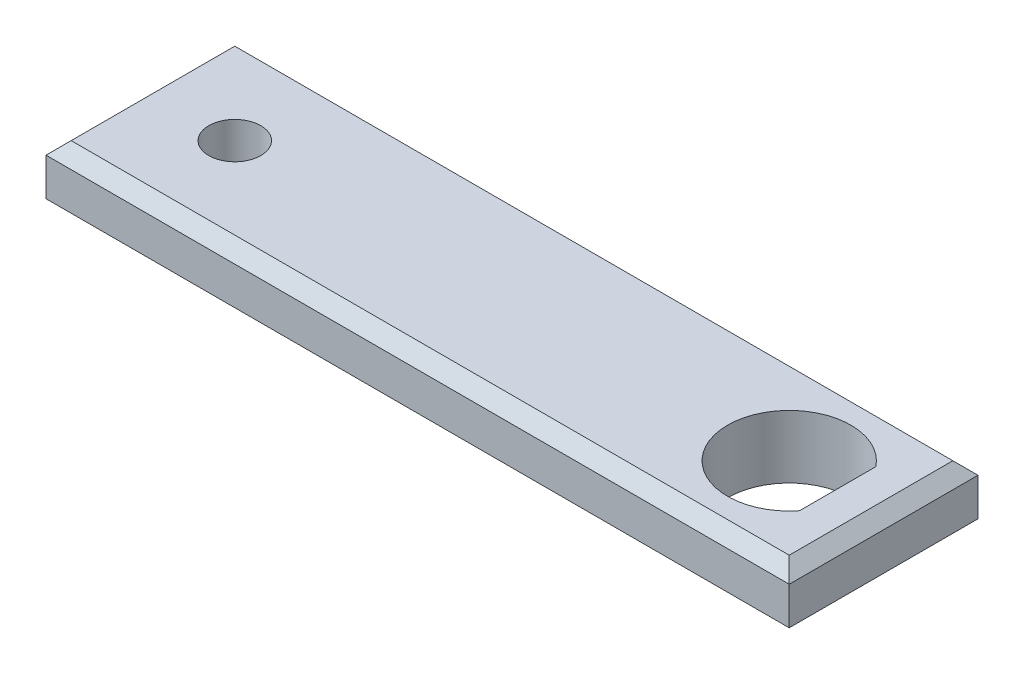
ISO-10303-21;
HEADER;
FILE_DESCRIPTION(('STEP AP214'),'2;1');
FILE_NAME('part.step','',(''),(''),'','','');
FILE_SCHEMA(('AUTOMOTIVE_DESIGN { 1 0 10303 214 1 1 1 1 }'));
ENDSEC;
DATA;
#1=APPLICATION_CONTEXT('core data for automotive mechanical design processes');
#2=APPLICATION_PROTOCOL_DEFINITION('international standard','automotive_design',2000,#1);
#3=PRODUCT_CONTEXT('',#1,'mechanical');
#4=PRODUCT('Part','Part','',(#3));
#5=PRODUCT_RELATED_PRODUCT_CATEGORY('part','',(#4));
#6=PRODUCT_DEFINITION_FORMATION('','',#4);
#7=PRODUCT_DEFINITION_CONTEXT('part definition',#1,'design');
#8=PRODUCT_DEFINITION('design','',#6,#7);
#9=PRODUCT_DEFINITION_SHAPE('','',#8);
#10=(LENGTH_UNIT() NAMED_UNIT(*) SI_UNIT(.MILLI.,.METRE.));
#11=(NAMED_UNIT(*) PLANE_ANGLE_UNIT() SI_UNIT($,.RADIAN.));
#12=(NAMED_UNIT(*) SI_UNIT($,.STERADIAN.) SOLID_ANGLE_UNIT());
#13=UNCERTAINTY_MEASURE_WITH_UNIT(LENGTH_MEASURE(1.E-05),#10,'distance_accuracy_value','');
#14=(GEOMETRIC_REPRESENTATION_CONTEXT(3) GLOBAL_UNCERTAINTY_ASSIGNED_CONTEXT((#13)) GLOBAL_UNIT_ASSIGNED_CONTEXT((#10,
#11,#12)) REPRESENTATION_CONTEXT('',''));
#15=CARTESIAN_POINT('',(0.,0.,0.));
#16=DIRECTION('',(0.,0.,1.));
#17=DIRECTION('',(1.,0.,0.));
#18=AXIS2_PLACEMENT_3D('',#15,#16,#17);
#19=CARTESIAN_POINT('',(0.,0.,19.05));
#20=DIRECTION('',(-1.,0.,0.));
#21=DIRECTION('',(0.,0.,1.));
#22=AXIS2_PLACEMENT_3D('',#19,#20,#21);
#23=PLANE('',#22);
#24=DIRECTION('',(0.,1.,0.));
#25=VECTOR('',#24,1.);
#26=CARTESIAN_POINT('',(0.,0.,0.));
#27=LINE('',#26,#25);
#28=CARTESIAN_POINT('',(0.,1.26999999999999,0.));
#29=VERTEX_POINT('',#28);
#30=CARTESIAN_POINT('',(0.,5.08000000000003,0.));
#31=VERTEX_POINT('',#30);
#32=EDGE_CURVE('E141',#29,#31,#27,.T.);
#33=ORIENTED_EDGE('',*,*,#32,.F.);
#34=DIRECTION('',(0.,0.,1.));
#35=VECTOR('',#34,1.);
#36=CARTESIAN_POINT('',(0.,1.26999999999999,19.05));
#37=LINE('',#36,#35);
#38=CARTESIAN_POINT('',(0.,1.26999999999999,19.05));
#39=VERTEX_POINT('',#38);
#40=EDGE_CURVE('E175',#29,#39,#37,.T.);
#41=ORIENTED_EDGE('',*,*,#40,.T.);
#42=DIRECTION('',(0.,1.,0.));
#43=VECTOR('',#42,1.);
#44=CARTESIAN_POINT('',(0.,0.,19.05));
#45=LINE('',#44,#43);
#46=CARTESIAN_POINT('',(0.,5.08000000000003,19.05));
#47=VERTEX_POINT('',#46);
#48=EDGE_CURVE('E143',#39,#47,#45,.T.);
#49=ORIENTED_EDGE('',*,*,#48,.T.);
#50=DIRECTION('',(0.,0.,-1.));
#51=VECTOR('',#50,1.);
#52=CARTESIAN_POINT('',(0.,5.08000000000003,0.));
#53=LINE('',#52,#51);
#54=EDGE_CURVE('E173',#47,#31,#53,.T.);
#55=ORIENTED_EDGE('',*,*,#54,.T.);
#56=EDGE_LOOP('',(#33,#41,#49,#55));
#57=FACE_BOUND('',#56,.T.);
#58=ADVANCED_FACE('F37',(#57),#23,.T.);
#59=CARTESIAN_POINT('',(0.,0.,19.05));
#60=DIRECTION('',(0.,1.,0.));
#61=DIRECTION('',(0.,0.,1.));
#62=AXIS2_PLACEMENT_3D('',#59,#60,#61);
#63=PLANE('',#62);
#64=DIRECTION('',(1.,0.,0.));
#65=VECTOR('',#64,1.);
#66=CARTESIAN_POINT('',(75.,0.,1.26999999999999));
#67=LINE('',#66,#65);
#68=CARTESIAN_POINT('',(1.26999999999999,0.,1.26999999999999));
#69=VERTEX_POINT('',#68);
#70=CARTESIAN_POINT('',(73.73,0.,1.26999999999999));
#71=VERTEX_POINT('',#70);
#72=EDGE_CURVE('E160',#69,#71,#67,.T.);
#73=ORIENTED_EDGE('',*,*,#72,.T.);
#74=DIRECTION('',(0.,0.,1.));
#75=VECTOR('',#74,1.);
#76=CARTESIAN_POINT('',(73.73,0.,19.05));
#77=LINE('',#76,#75);
#78=CARTESIAN_POINT('',(73.73,0.,17.78));
#79=VERTEX_POINT('',#78);
#80=EDGE_CURVE('E166',#71,#79,#77,.T.);
#81=ORIENTED_EDGE('',*,*,#80,.T.);
#82=DIRECTION('',(-1.,0.,0.));
#83=VECTOR('',#82,1.);
#84=CARTESIAN_POINT('',(0.,0.,17.78));
#85=LINE('',#84,#83);
#86=CARTESIAN_POINT('',(1.26999999999999,0.,17.78));
#87=VERTEX_POINT('',#86);
#88=EDGE_CURVE('E164',#79,#87,#85,.T.);
#89=ORIENTED_EDGE('',*,*,#88,.T.);
#90=DIRECTION('',(0.,0.,-1.));
#91=VECTOR('',#90,1.);
#92=CARTESIAN_POINT('',(1.26999999999999,0.,0.));
#93=LINE('',#92,#91);
#94=EDGE_CURVE('E162',#87,#69,#93,.T.);
#95=ORIENTED_EDGE('',*,*,#94,.T.);
#96=EDGE_LOOP('',(#73,#81,#89,#95));
#97=FACE_BOUND('',#96,.T.);
#98=CARTESIAN_POINT('',(9.525,0.,9.525));
#99=DIRECTION('',(0.,1.,0.));
#100=DIRECTION('',(-1.,0.,0.));
#101=AXIS2_PLACEMENT_3D('',#98,#99,#100);
#102=CIRCLE('',#101,2.62246009401009);
#103=CARTESIAN_POINT('',(6.90253990598991,0.,9.525));
#104=VERTEX_POINT('',#103);
#105=EDGE_CURVE('E139',#104,#104,#102,.T.);
#106=ORIENTED_EDGE('',*,*,#105,.T.);
#107=EDGE_LOOP('',(#106));
#108=FACE_BOUND('',#107,.T.);
#109=DIRECTION('',(0.,0.,1.));
#110=VECTOR('',#109,1.);
#111=CARTESIAN_POINT('',(70.3645,0.,5.67551708017818));
#112=LINE('',#111,#110);
#113=CARTESIAN_POINT('',(70.3645,0.,5.67551708017818));
#114=VERTEX_POINT('',#113);
#115=CARTESIAN_POINT('',(70.3645,0.,13.3744829198218));
#116=VERTEX_POINT('',#115);
#117=EDGE_CURVE('E115',#114,#116,#112,.T.);
#118=ORIENTED_EDGE('',*,*,#117,.F.);
#119=CARTESIAN_POINT('',(65.475,0.,9.525));
#120=DIRECTION('',(0.,1.,0.));
#121=DIRECTION('',(-1.,0.,0.));
#122=AXIS2_PLACEMENT_3D('',#119,#120,#121);
#123=CIRCLE('',#122,6.22300000000001);
#124=EDGE_CURVE('E124',#114,#116,#123,.T.);
#125=ORIENTED_EDGE('',*,*,#124,.T.);
#126=EDGE_LOOP('',(#118,#125));
#127=FACE_BOUND('',#126,.T.);
#128=ADVANCED_FACE('F131',(#97,#108,#127),#63,.F.);
#129=CARTESIAN_POINT('',(75.,6.34999999999999,19.05));
#130=DIRECTION('',(1.,0.,0.));
#131=DIRECTION('',(0.,0.,-1.));
#132=AXIS2_PLACEMENT_3D('',#129,#130,#131);
#133=PLANE('',#132);
#134=DIRECTION('',(0.,-1.,0.));
#135=VECTOR('',#134,1.);
#136=CARTESIAN_POINT('',(75.,6.34999999999999,19.05));
#137=LINE('',#136,#135);
#138=CARTESIAN_POINT('',(75.,5.08,19.05));
#139=VERTEX_POINT('',#138);
#140=CARTESIAN_POINT('',(75.,1.26999999999999,19.05));
#141=VERTEX_POINT('',#140);
#142=EDGE_CURVE('E146',#139,#141,#137,.T.);
#143=ORIENTED_EDGE('',*,*,#142,.T.);
#144=DIRECTION('',(0.,0.,-1.));
#145=VECTOR('',#144,1.);
#146=CARTESIAN_POINT('',(75.,1.26999999999999,0.));
#147=LINE('',#146,#145);
#148=CARTESIAN_POINT('',(75.,1.26999999999999,0.));
#149=VERTEX_POINT('',#148);
#150=EDGE_CURVE('E157',#141,#149,#147,.T.);
#151=ORIENTED_EDGE('',*,*,#150,.T.);
#152=DIRECTION('',(0.,-1.,0.));
#153=VECTOR('',#152,1.);
#154=CARTESIAN_POINT('',(75.,6.34999999999999,0.));
#155=LINE('',#154,#153);
#156=CARTESIAN_POINT('',(75.,5.08,0.));
#157=VERTEX_POINT('',#156);
#158=EDGE_CURVE('E147',#157,#149,#155,.T.);
#159=ORIENTED_EDGE('',*,*,#158,.F.);
#160=DIRECTION('',(0.,0.,1.));
#161=VECTOR('',#160,1.);
#162=CARTESIAN_POINT('',(75.,5.08,19.05));
#163=LINE('',#162,#161);
#164=EDGE_CURVE('E150',#157,#139,#163,.T.);
#165=ORIENTED_EDGE('',*,*,#164,.T.);
#166=EDGE_LOOP('',(#143,#151,#159,#165));
#167=FACE_BOUND('',#166,.T.);
#168=ADVANCED_FACE('F225',(#167),#133,.T.);
#169=CARTESIAN_POINT('',(75.,6.34999999999999,19.05));
#170=DIRECTION('',(0.,-1.,0.));
#171=DIRECTION('',(1.,0.,0.));
#172=AXIS2_PLACEMENT_3D('',#169,#170,#171);
#173=PLANE('',#172);
#174=DIRECTION('',(1.,0.,0.));
#175=VECTOR('',#174,1.);
#176=CARTESIAN_POINT('',(75.,6.34999999999999,17.78));
#177=LINE('',#176,#175);
#178=CARTESIAN_POINT('',(1.27000000000001,6.35000000000001,17.78));
#179=VERTEX_POINT('',#178);
#180=CARTESIAN_POINT('',(73.73,6.34999999999999,17.78));
#181=VERTEX_POINT('',#180);
#182=EDGE_CURVE('E46',#179,#181,#177,.T.);
#183=ORIENTED_EDGE('',*,*,#182,.T.);
#184=DIRECTION('',(0.,0.,-1.));
#185=VECTOR('',#184,1.);
#186=CARTESIAN_POINT('',(73.73,6.34999999999999,0.));
#187=LINE('',#186,#185);
#188=CARTESIAN_POINT('',(73.73,6.34999999999999,1.26999999999999));
#189=VERTEX_POINT('',#188);
#190=EDGE_CURVE('E11',#181,#189,#187,.T.);
#191=ORIENTED_EDGE('',*,*,#190,.T.);
#192=DIRECTION('',(-1.,0.,0.));
#193=VECTOR('',#192,1.);
#194=CARTESIAN_POINT('',(0.,6.35000000000001,1.26999999999999));
#195=LINE('',#194,#193);
#196=CARTESIAN_POINT('',(1.27000000000001,6.35000000000001,1.26999999999999));
#197=VERTEX_POINT('',#196);
#198=EDGE_CURVE('E181',#189,#197,#195,.T.);
#199=ORIENTED_EDGE('',*,*,#198,.T.);
#200=DIRECTION('',(0.,0.,1.));
#201=VECTOR('',#200,1.);
#202=CARTESIAN_POINT('',(1.27000000000001,6.35000000000001,19.05));
#203=LINE('',#202,#201);
#204=EDGE_CURVE('E57',#197,#179,#203,.T.);
#205=ORIENTED_EDGE('',*,*,#204,.T.);
#206=EDGE_LOOP('',(#183,#191,#199,#205));
#207=FACE_BOUND('',#206,.T.);
#208=CARTESIAN_POINT('',(9.525,6.35000000000001,9.525));
#209=DIRECTION('',(0.,1.,0.));
#210=DIRECTION('',(-1.,0.,0.));
#211=AXIS2_PLACEMENT_3D('',#208,#209,#210);
#212=CIRCLE('',#211,2.62246009401009);
#213=CARTESIAN_POINT('',(6.90253990598991,6.35000000000001,9.525));
#214=VERTEX_POINT('',#213);
#215=EDGE_CURVE('E136',#214,#214,#212,.T.);
#216=ORIENTED_EDGE('',*,*,#215,.F.);
#217=EDGE_LOOP('',(#216));
#218=FACE_BOUND('',#217,.T.);
#219=DIRECTION('',(0.,0.,1.));
#220=VECTOR('',#219,1.);
#221=CARTESIAN_POINT('',(70.3645,6.35,5.67551708017818));
#222=LINE('',#221,#220);
#223=CARTESIAN_POINT('',(70.3645,6.35,5.67551708017818));
#224=VERTEX_POINT('',#223);
#225=CARTESIAN_POINT('',(70.3645,6.34999999999999,13.3744829198218));
#226=VERTEX_POINT('',#225);
#227=EDGE_CURVE('E132',#224,#226,#222,.T.);
#228=ORIENTED_EDGE('',*,*,#227,.T.);
#229=CARTESIAN_POINT('',(65.475,6.35000000000001,9.525));
#230=DIRECTION('',(0.,1.,0.));
#231=DIRECTION('',(-1.,0.,0.));
#232=AXIS2_PLACEMENT_3D('',#229,#230,#231);
#233=CIRCLE('',#232,6.22300000000001);
#234=EDGE_CURVE('E129',#224,#226,#233,.T.);
#235=ORIENTED_EDGE('',*,*,#234,.F.);
#236=EDGE_LOOP('',(#228,#235));
#237=FACE_BOUND('',#236,.T.);
#238=ADVANCED_FACE('F261',(#207,#218,#237),#173,.F.);
#239=CARTESIAN_POINT('',(0.,0.,19.05));
#240=DIRECTION('',(0.,0.,-1.));
#241=DIRECTION('',(-1.,0.,0.));
#242=AXIS2_PLACEMENT_3D('',#239,#240,#241);
#243=PLANE('',#242);
#244=ORIENTED_EDGE('',*,*,#48,.F.);
#245=DIRECTION('',(1.,0.,0.));
#246=VECTOR('',#245,1.);
#247=CARTESIAN_POINT('',(0.,1.26999999999999,19.05));
#248=LINE('',#247,#246);
#249=EDGE_CURVE('E171',#39,#141,#248,.T.);
#250=ORIENTED_EDGE('',*,*,#249,.T.);
#251=ORIENTED_EDGE('',*,*,#142,.F.);
#252=DIRECTION('',(-1.,0.,0.));
#253=VECTOR('',#252,1.);
#254=CARTESIAN_POINT('',(0.,5.08000000000003,19.05));
#255=LINE('',#254,#253);
#256=EDGE_CURVE('E169',#139,#47,#255,.T.);
#257=ORIENTED_EDGE('',*,*,#256,.T.);
#258=EDGE_LOOP('',(#244,#250,#251,#257));
#259=FACE_BOUND('',#258,.T.);
#260=ADVANCED_FACE('F241',(#259),#243,.F.);
#261=CARTESIAN_POINT('',(0.,0.,0.));
#262=DIRECTION('',(0.,0.,-1.));
#263=DIRECTION('',(-1.,0.,0.));
#264=AXIS2_PLACEMENT_3D('',#261,#262,#263);
#265=PLANE('',#264);
#266=ORIENTED_EDGE('',*,*,#158,.T.);
#267=DIRECTION('',(-1.,0.,0.));
#268=VECTOR('',#267,1.);
#269=CARTESIAN_POINT('',(0.,1.26999999999999,0.));
#270=LINE('',#269,#268);
#271=EDGE_CURVE('E179',#149,#29,#270,.T.);
#272=ORIENTED_EDGE('',*,*,#271,.T.);
#273=ORIENTED_EDGE('',*,*,#32,.T.);
#274=DIRECTION('',(1.,0.,0.));
#275=VECTOR('',#274,1.);
#276=CARTESIAN_POINT('',(75.,5.08,0.));
#277=LINE('',#276,#275);
#278=EDGE_CURVE('E177',#31,#157,#277,.T.);
#279=ORIENTED_EDGE('',*,*,#278,.T.);
#280=EDGE_LOOP('',(#266,#272,#273,#279));
#281=FACE_BOUND('',#280,.T.);
#282=ADVANCED_FACE('F215',(#281),#265,.T.);
#283=CARTESIAN_POINT('',(65.475,0.,9.525));
#284=DIRECTION('',(0.,1.,0.));
#285=DIRECTION('',(-1.,0.,0.));
#286=AXIS2_PLACEMENT_3D('',#283,#284,#285);
#287=CYLINDRICAL_SURFACE('',#286,6.22300000000001);
#288=ORIENTED_EDGE('',*,*,#234,.T.);
#289=DIRECTION('',(0.,1.,0.));
#290=VECTOR('',#289,1.);
#291=CARTESIAN_POINT('',(70.3645,0.,13.3744829198218));
#292=LINE('',#291,#290);
#293=EDGE_CURVE('E119',#116,#226,#292,.T.);
#294=ORIENTED_EDGE('',*,*,#293,.F.);
#295=ORIENTED_EDGE('',*,*,#124,.F.);
#296=DIRECTION('',(0.,1.,0.));
#297=VECTOR('',#296,1.);
#298=CARTESIAN_POINT('',(70.3645,0.,5.67551708017818));
#299=LINE('',#298,#297);
#300=EDGE_CURVE('E121',#114,#224,#299,.T.);
#301=ORIENTED_EDGE('',*,*,#300,.T.);
#302=EDGE_LOOP('',(#288,#294,#295,#301));
#303=FACE_BOUND('',#302,.T.);
#304=ADVANCED_FACE('F127',(#303),#287,.F.);
#305=CARTESIAN_POINT('',(70.3645,0.,5.67551708017818));
#306=DIRECTION('',(-1.,0.,0.));
#307=DIRECTION('',(0.,-1.,0.));
#308=AXIS2_PLACEMENT_3D('',#305,#306,#307);
#309=PLANE('',#308);
#310=ORIENTED_EDGE('',*,*,#227,.F.);
#311=ORIENTED_EDGE('',*,*,#300,.F.);
#312=ORIENTED_EDGE('',*,*,#117,.T.);
#313=ORIENTED_EDGE('',*,*,#293,.T.);
#314=EDGE_LOOP('',(#310,#311,#312,#313));
#315=FACE_BOUND('',#314,.T.);
#316=ADVANCED_FACE('F118',(#315),#309,.T.);
#317=CARTESIAN_POINT('',(9.525,0.,9.525));
#318=DIRECTION('',(0.,1.,0.));
#319=DIRECTION('',(-1.,0.,0.));
#320=AXIS2_PLACEMENT_3D('',#317,#318,#319);
#321=CYLINDRICAL_SURFACE('',#320,2.62246009401009);
#322=ORIENTED_EDGE('',*,*,#105,.F.);
#323=EDGE_LOOP('',(#322));
#324=FACE_BOUND('',#323,.T.);
#325=ORIENTED_EDGE('',*,*,#215,.T.);
#326=EDGE_LOOP('',(#325));
#327=FACE_BOUND('',#326,.T.);
#328=ADVANCED_FACE('F251',(#324,#327),#321,.F.);
#329=CARTESIAN_POINT('',(1.26999999999999,0.,19.05));
#330=DIRECTION('',(-0.707106781186546,-0.707106781186549,0.));
#331=DIRECTION('',(0.,0.,1.));
#332=AXIS2_PLACEMENT_3D('',#329,#330,#331);
#333=PLANE('',#332);
#334=DIRECTION('',(-0.577350269189627,0.577350269189624,-0.577350269189627));
#335=VECTOR('',#334,1.);
#336=CARTESIAN_POINT('',(0.84666666666666,0.42333333333333,0.846666666666661));
#337=LINE('',#336,#335);
#338=EDGE_CURVE('E189',#69,#29,#337,.T.);
#339=ORIENTED_EDGE('',*,*,#338,.F.);
#340=ORIENTED_EDGE('',*,*,#94,.F.);
#341=DIRECTION('',(0.577350269189627,-0.577350269189624,-0.577350269189627));
#342=VECTOR('',#341,1.);
#343=CARTESIAN_POINT('',(0.84666666666666,0.42333333333333,18.2033333333333));
#344=LINE('',#343,#342);
#345=EDGE_CURVE('E192',#39,#87,#344,.T.);
#346=ORIENTED_EDGE('',*,*,#345,.F.);
#347=ORIENTED_EDGE('',*,*,#40,.F.);
#348=EDGE_LOOP('',(#339,#340,#346,#347));
#349=FACE_BOUND('',#348,.T.);
#350=ADVANCED_FACE('F238',(#349),#333,.T.);
#351=CARTESIAN_POINT('',(0.,1.26999999999999,19.05));
#352=DIRECTION('',(0.,0.70710678118655,-0.707106781186545));
#353=DIRECTION('',(1.,0.,0.));
#354=AXIS2_PLACEMENT_3D('',#351,#352,#353);
#355=PLANE('',#354);
#356=ORIENTED_EDGE('',*,*,#345,.T.);
#357=ORIENTED_EDGE('',*,*,#88,.F.);
#358=DIRECTION('',(-0.577350269189631,-0.577350269189622,-0.577350269189625));
#359=VECTOR('',#358,1.);
#360=CARTESIAN_POINT('',(49.9999999999996,-23.7300000000001,-5.95000000000019));
#361=LINE('',#360,#359);
#362=EDGE_CURVE('E187',#141,#79,#361,.T.);
#363=ORIENTED_EDGE('',*,*,#362,.F.);
#364=ORIENTED_EDGE('',*,*,#249,.F.);
#365=EDGE_LOOP('',(#356,#357,#363,#364));
#366=FACE_BOUND('',#365,.T.);
#367=ADVANCED_FACE('F243',(#366),#355,.F.);
#368=CARTESIAN_POINT('',(0.,0.,1.26999999999999));
#369=DIRECTION('',(0.,-0.70710678118655,-0.707106781186545));
#370=DIRECTION('',(-1.,0.,0.));
#371=AXIS2_PLACEMENT_3D('',#368,#369,#370);
#372=PLANE('',#371);
#373=ORIENTED_EDGE('',*,*,#338,.T.);
#374=ORIENTED_EDGE('',*,*,#271,.F.);
#375=DIRECTION('',(-0.577350269189631,-0.577350269189622,0.577350269189625));
#376=VECTOR('',#375,1.);
#377=CARTESIAN_POINT('',(49.1533333333329,-24.5766666666667,25.8466666666668));
#378=LINE('',#377,#376);
#379=EDGE_CURVE('E185',#71,#149,#378,.F.);
#380=ORIENTED_EDGE('',*,*,#379,.F.);
#381=ORIENTED_EDGE('',*,*,#72,.F.);
#382=EDGE_LOOP('',(#373,#374,#380,#381));
#383=FACE_BOUND('',#382,.T.);
#384=ADVANCED_FACE('F220',(#383),#372,.T.);
#385=CARTESIAN_POINT('',(75.,1.26999999999999,19.05));
#386=DIRECTION('',(0.707106781186542,-0.707106781186553,0.));
#387=DIRECTION('',(0.,0.,1.));
#388=AXIS2_PLACEMENT_3D('',#385,#386,#387);
#389=PLANE('',#388);
#390=ORIENTED_EDGE('',*,*,#362,.T.);
#391=ORIENTED_EDGE('',*,*,#80,.F.);
#392=ORIENTED_EDGE('',*,*,#379,.T.);
#393=ORIENTED_EDGE('',*,*,#150,.F.);
#394=EDGE_LOOP('',(#390,#391,#392,#393));
#395=FACE_BOUND('',#394,.T.);
#396=ADVANCED_FACE('F230',(#395),#389,.T.);
#397=CARTESIAN_POINT('',(0.,5.08000000000003,19.05));
#398=DIRECTION('',(-0.707106781186542,0.707106781186553,0.));
#399=DIRECTION('',(0.,0.,1.));
#400=AXIS2_PLACEMENT_3D('',#397,#398,#399);
#401=PLANE('',#400);
#402=DIRECTION('',(0.577350269189631,0.577350269189622,0.577350269189625));
#403=VECTOR('',#402,1.);
#404=CARTESIAN_POINT('',(25.8466666666671,30.9266666666667,25.8466666666668));
#405=LINE('',#404,#403);
#406=EDGE_CURVE('E198',#31,#197,#405,.T.);
#407=ORIENTED_EDGE('',*,*,#406,.F.);
#408=ORIENTED_EDGE('',*,*,#54,.F.);
#409=DIRECTION('',(-0.577350269189631,-0.577350269189622,0.577350269189625));
#410=VECTOR('',#409,1.);
#411=CARTESIAN_POINT('',(0.,5.08000000000003,19.05));
#412=LINE('',#411,#410);
#413=EDGE_CURVE('E41',#179,#47,#412,.T.);
#414=ORIENTED_EDGE('',*,*,#413,.F.);
#415=ORIENTED_EDGE('',*,*,#204,.F.);
#416=EDGE_LOOP('',(#407,#408,#414,#415));
#417=FACE_BOUND('',#416,.T.);
#418=ADVANCED_FACE('F39',(#417),#401,.T.);
#419=CARTESIAN_POINT('',(0.,5.08000000000003,19.05));
#420=DIRECTION('',(0.,-0.707106781186549,-0.707106781186546));
#421=DIRECTION('',(-1.,0.,0.));
#422=AXIS2_PLACEMENT_3D('',#419,#420,#421);
#423=PLANE('',#422);
#424=ORIENTED_EDGE('',*,*,#413,.T.);
#425=ORIENTED_EDGE('',*,*,#256,.F.);
#426=DIRECTION('',(0.577350269189627,-0.577350269189624,0.577350269189627));
#427=VECTOR('',#426,1.);
#428=CARTESIAN_POINT('',(49.9999999999999,30.08,-5.9500000000001));
#429=LINE('',#428,#427);
#430=EDGE_CURVE('E197',#181,#139,#429,.T.);
#431=ORIENTED_EDGE('',*,*,#430,.F.);
#432=ORIENTED_EDGE('',*,*,#182,.F.);
#433=EDGE_LOOP('',(#424,#425,#431,#432));
#434=FACE_BOUND('',#433,.T.);
#435=ADVANCED_FACE('F207',(#434),#423,.F.);
#436=CARTESIAN_POINT('',(75.,6.34999999999999,1.26999999999999));
#437=DIRECTION('',(0.,0.707106781186549,-0.707106781186546));
#438=DIRECTION('',(1.,0.,0.));
#439=AXIS2_PLACEMENT_3D('',#436,#437,#438);
#440=PLANE('',#439);
#441=ORIENTED_EDGE('',*,*,#406,.T.);
#442=ORIENTED_EDGE('',*,*,#198,.F.);
#443=DIRECTION('',(0.577350269189627,-0.577350269189624,-0.577350269189627));
#444=VECTOR('',#443,1.);
#445=CARTESIAN_POINT('',(74.1533333333333,5.92666666666666,0.84666666666666));
#446=LINE('',#445,#444);
#447=EDGE_CURVE('E195',#157,#189,#446,.F.);
#448=ORIENTED_EDGE('',*,*,#447,.F.);
#449=ORIENTED_EDGE('',*,*,#278,.F.);
#450=EDGE_LOOP('',(#441,#442,#448,#449));
#451=FACE_BOUND('',#450,.T.);
#452=ADVANCED_FACE('F270',(#451),#440,.T.);
#453=CARTESIAN_POINT('',(73.73,6.34999999999999,19.05));
#454=DIRECTION('',(0.707106781186545,0.70710678118655,0.));
#455=DIRECTION('',(0.,0.,1.));
#456=AXIS2_PLACEMENT_3D('',#453,#454,#455);
#457=PLANE('',#456);
#458=ORIENTED_EDGE('',*,*,#430,.T.);
#459=ORIENTED_EDGE('',*,*,#164,.F.);
#460=ORIENTED_EDGE('',*,*,#447,.T.);
#461=ORIENTED_EDGE('',*,*,#190,.F.);
#462=EDGE_LOOP('',(#458,#459,#460,#461));
#463=FACE_BOUND('',#462,.T.);
#464=ADVANCED_FACE('F274',(#463),#457,.T.);
#465=CLOSED_SHELL('',(#58,#128,#168,#238,#260,#282,#304,#316,#328,#350,#367,#384,#396,#418,#435,
#452,#464));
#466=MANIFOLD_SOLID_BREP('B2',#465);
#467=ADVANCED_BREP_SHAPE_REPRESENTATION('',(#18,#466),#14);
#468=SHAPE_DEFINITION_REPRESENTATION(#9,#467);
ENDSEC;
END-ISO-10303-21;
